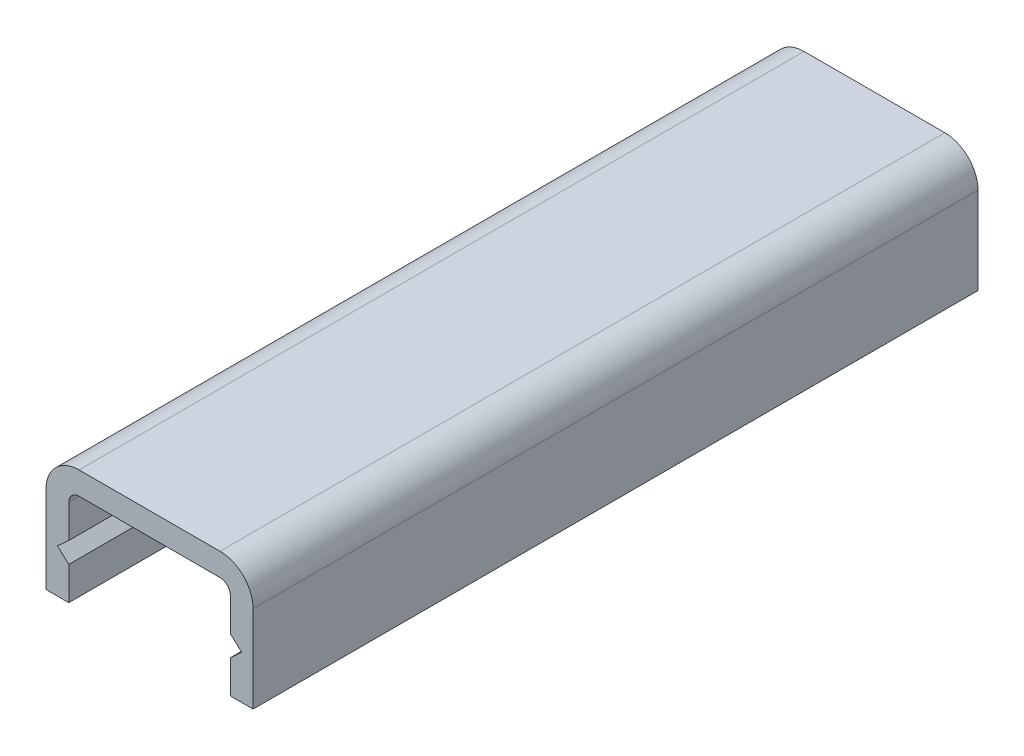
ISO-10303-21;
HEADER;
FILE_DESCRIPTION(('STEP AP214'),'2;1');
FILE_NAME('part.step','',(''),(''),'','','');
FILE_SCHEMA(('AUTOMOTIVE_DESIGN { 1 0 10303 214 1 1 1 1 }'));
ENDSEC;
DATA;
#1=APPLICATION_CONTEXT('core data for automotive mechanical design processes');
#2=APPLICATION_PROTOCOL_DEFINITION('international standard','automotive_design',2000,#1);
#3=PRODUCT_CONTEXT('',#1,'mechanical');
#4=PRODUCT('Part','Part','',(#3));
#5=PRODUCT_RELATED_PRODUCT_CATEGORY('part','',(#4));
#6=PRODUCT_DEFINITION_FORMATION('','',#4);
#7=PRODUCT_DEFINITION_CONTEXT('part definition',#1,'design');
#8=PRODUCT_DEFINITION('design','',#6,#7);
#9=PRODUCT_DEFINITION_SHAPE('','',#8);
#10=(LENGTH_UNIT() NAMED_UNIT(*) SI_UNIT(.MILLI.,.METRE.));
#11=(NAMED_UNIT(*) PLANE_ANGLE_UNIT() SI_UNIT($,.RADIAN.));
#12=(NAMED_UNIT(*) SI_UNIT($,.STERADIAN.) SOLID_ANGLE_UNIT());
#13=UNCERTAINTY_MEASURE_WITH_UNIT(LENGTH_MEASURE(1.E-05),#10,'distance_accuracy_value','');
#14=(GEOMETRIC_REPRESENTATION_CONTEXT(3) GLOBAL_UNCERTAINTY_ASSIGNED_CONTEXT((#13)) GLOBAL_UNIT_ASSIGNED_CONTEXT((#10,
#11,#12)) REPRESENTATION_CONTEXT('',''));
#15=CARTESIAN_POINT('',(0.,0.,0.));
#16=DIRECTION('',(0.,0.,1.));
#17=DIRECTION('',(1.,0.,0.));
#18=AXIS2_PLACEMENT_3D('',#15,#16,#17);
#19=CARTESIAN_POINT('',(0.,0.,35.));
#20=DIRECTION('',(0.,1.,0.));
#21=DIRECTION('',(0.,0.,1.));
#22=AXIS2_PLACEMENT_3D('',#19,#20,#21);
#23=PLANE('',#22);
#24=DIRECTION('',(1.,0.,0.));
#25=VECTOR('',#24,1.);
#26=CARTESIAN_POINT('',(0.,0.,0.));
#27=LINE('',#26,#25);
#28=CARTESIAN_POINT('',(0.,0.,0.));
#29=VERTEX_POINT('',#28);
#30=CARTESIAN_POINT('',(1.1,0.,0.));
#31=VERTEX_POINT('',#30);
#32=EDGE_CURVE('E187',#29,#31,#27,.T.);
#33=ORIENTED_EDGE('',*,*,#32,.T.);
#34=DIRECTION('',(0.,0.,-1.));
#35=VECTOR('',#34,1.);
#36=CARTESIAN_POINT('',(1.1,0.,35.));
#37=LINE('',#36,#35);
#38=CARTESIAN_POINT('',(1.1,0.,35.));
#39=VERTEX_POINT('',#38);
#40=EDGE_CURVE('E11',#39,#31,#37,.T.);
#41=ORIENTED_EDGE('',*,*,#40,.F.);
#42=DIRECTION('',(1.,0.,0.));
#43=VECTOR('',#42,1.);
#44=CARTESIAN_POINT('',(0.,0.,35.));
#45=LINE('',#44,#43);
#46=CARTESIAN_POINT('',(0.,0.,35.));
#47=VERTEX_POINT('',#46);
#48=EDGE_CURVE('E221',#47,#39,#45,.T.);
#49=ORIENTED_EDGE('',*,*,#48,.F.);
#50=DIRECTION('',(0.,0.,-1.));
#51=VECTOR('',#50,1.);
#52=CARTESIAN_POINT('',(0.,0.,35.));
#53=LINE('',#52,#51);
#54=EDGE_CURVE('E183',#47,#29,#53,.T.);
#55=ORIENTED_EDGE('',*,*,#54,.T.);
#56=EDGE_LOOP('',(#33,#41,#49,#55));
#57=FACE_BOUND('',#56,.T.);
#58=ADVANCED_FACE('F31',(#57),#23,.F.);
#59=CARTESIAN_POINT('',(1.1,1.6,35.));
#60=DIRECTION('',(-1.,0.,0.));
#61=DIRECTION('',(0.,0.,1.));
#62=AXIS2_PLACEMENT_3D('',#59,#60,#61);
#63=PLANE('',#62);
#64=DIRECTION('',(0.,1.,0.));
#65=VECTOR('',#64,1.);
#66=CARTESIAN_POINT('',(1.1,1.6,0.));
#67=LINE('',#66,#65);
#68=CARTESIAN_POINT('',(1.1,1.6,0.));
#69=VERTEX_POINT('',#68);
#70=EDGE_CURVE('E190',#31,#69,#67,.T.);
#71=ORIENTED_EDGE('',*,*,#70,.T.);
#72=DIRECTION('',(0.,0.,-1.));
#73=VECTOR('',#72,1.);
#74=CARTESIAN_POINT('',(1.1,1.6,35.));
#75=LINE('',#74,#73);
#76=CARTESIAN_POINT('',(1.1,1.6,35.));
#77=VERTEX_POINT('',#76);
#78=EDGE_CURVE('E39',#77,#69,#75,.T.);
#79=ORIENTED_EDGE('',*,*,#78,.F.);
#80=DIRECTION('',(0.,1.,0.));
#81=VECTOR('',#80,1.);
#82=CARTESIAN_POINT('',(1.1,1.6,35.));
#83=LINE('',#82,#81);
#84=EDGE_CURVE('E120',#39,#77,#83,.T.);
#85=ORIENTED_EDGE('',*,*,#84,.F.);
#86=ORIENTED_EDGE('',*,*,#40,.T.);
#87=EDGE_LOOP('',(#71,#79,#85,#86));
#88=FACE_BOUND('',#87,.T.);
#89=ADVANCED_FACE('F329',(#88),#63,.F.);
#90=CARTESIAN_POINT('',(1.1,1.6,35.));
#91=DIRECTION('',(-0.672672793996314,-0.739940073395943,0.));
#92=DIRECTION('',(0.739940073395943,-0.672672793996314,0.));
#93=AXIS2_PLACEMENT_3D('',#90,#91,#92);
#94=PLANE('',#93);
#95=DIRECTION('',(-0.739940073395943,0.672672793996314,0.));
#96=VECTOR('',#95,1.);
#97=CARTESIAN_POINT('',(1.1,1.6,0.));
#98=LINE('',#97,#96);
#99=CARTESIAN_POINT('',(0.55,2.1,0.));
#100=VERTEX_POINT('',#99);
#101=EDGE_CURVE('E192',#69,#100,#98,.T.);
#102=ORIENTED_EDGE('',*,*,#101,.T.);
#103=DIRECTION('',(0.,0.,-1.));
#104=VECTOR('',#103,1.);
#105=CARTESIAN_POINT('',(0.55,2.1,35.));
#106=LINE('',#105,#104);
#107=CARTESIAN_POINT('',(0.55,2.1,35.));
#108=VERTEX_POINT('',#107);
#109=EDGE_CURVE('E258',#108,#100,#106,.T.);
#110=ORIENTED_EDGE('',*,*,#109,.F.);
#111=DIRECTION('',(-0.739940073395943,0.672672793996314,0.));
#112=VECTOR('',#111,1.);
#113=CARTESIAN_POINT('',(1.1,1.6,35.));
#114=LINE('',#113,#112);
#115=EDGE_CURVE('E266',#77,#108,#114,.T.);
#116=ORIENTED_EDGE('',*,*,#115,.F.);
#117=ORIENTED_EDGE('',*,*,#78,.T.);
#118=EDGE_LOOP('',(#102,#110,#116,#117));
#119=FACE_BOUND('',#118,.T.);
#120=ADVANCED_FACE('F264',(#119),#94,.F.);
#121=CARTESIAN_POINT('',(1.1,2.6,35.));
#122=DIRECTION('',(-0.672672793996311,0.739940073395945,0.));
#123=DIRECTION('',(-0.739940073395945,-0.672672793996311,0.));
#124=AXIS2_PLACEMENT_3D('',#121,#122,#123);
#125=PLANE('',#124);
#126=DIRECTION('',(0.739940073395945,0.672672793996311,0.));
#127=VECTOR('',#126,1.);
#128=CARTESIAN_POINT('',(1.1,2.6,0.));
#129=LINE('',#128,#127);
#130=CARTESIAN_POINT('',(1.1,2.6,0.));
#131=VERTEX_POINT('',#130);
#132=EDGE_CURVE('E194',#100,#131,#129,.T.);
#133=ORIENTED_EDGE('',*,*,#132,.T.);
#134=DIRECTION('',(0.,0.,-1.));
#135=VECTOR('',#134,1.);
#136=CARTESIAN_POINT('',(1.1,2.6,35.));
#137=LINE('',#136,#135);
#138=CARTESIAN_POINT('',(1.1,2.6,35.));
#139=VERTEX_POINT('',#138);
#140=EDGE_CURVE('E255',#139,#131,#137,.T.);
#141=ORIENTED_EDGE('',*,*,#140,.F.);
#142=DIRECTION('',(0.739940073395945,0.672672793996311,0.));
#143=VECTOR('',#142,1.);
#144=CARTESIAN_POINT('',(1.1,2.6,35.));
#145=LINE('',#144,#143);
#146=EDGE_CURVE('E284',#108,#139,#145,.T.);
#147=ORIENTED_EDGE('',*,*,#146,.F.);
#148=ORIENTED_EDGE('',*,*,#109,.T.);
#149=EDGE_LOOP('',(#133,#141,#147,#148));
#150=FACE_BOUND('',#149,.T.);
#151=ADVANCED_FACE('F275',(#150),#125,.F.);
#152=CARTESIAN_POINT('',(1.1,4.2,35.));
#153=DIRECTION('',(-1.,0.,0.));
#154=DIRECTION('',(0.,-1.,0.));
#155=AXIS2_PLACEMENT_3D('',#152,#153,#154);
#156=PLANE('',#155);
#157=DIRECTION('',(0.,1.,0.));
#158=VECTOR('',#157,1.);
#159=CARTESIAN_POINT('',(1.1,4.2,0.));
#160=LINE('',#159,#158);
#161=CARTESIAN_POINT('',(1.1,4.2,0.));
#162=VERTEX_POINT('',#161);
#163=EDGE_CURVE('E196',#131,#162,#160,.T.);
#164=ORIENTED_EDGE('',*,*,#163,.T.);
#165=DIRECTION('',(0.,0.,-1.));
#166=VECTOR('',#165,1.);
#167=CARTESIAN_POINT('',(1.1,4.2,35.));
#168=LINE('',#167,#166);
#169=CARTESIAN_POINT('',(1.1,4.2,35.));
#170=VERTEX_POINT('',#169);
#171=EDGE_CURVE('E252',#170,#162,#168,.T.);
#172=ORIENTED_EDGE('',*,*,#171,.F.);
#173=DIRECTION('',(0.,1.,0.));
#174=VECTOR('',#173,1.);
#175=CARTESIAN_POINT('',(1.1,4.2,35.));
#176=LINE('',#175,#174);
#177=EDGE_CURVE('E281',#139,#170,#176,.T.);
#178=ORIENTED_EDGE('',*,*,#177,.F.);
#179=ORIENTED_EDGE('',*,*,#140,.T.);
#180=EDGE_LOOP('',(#164,#172,#178,#179));
#181=FACE_BOUND('',#180,.T.);
#182=ADVANCED_FACE('F279',(#181),#156,.F.);
#183=CARTESIAN_POINT('',(1.59999999999999,4.2,35.));
#184=DIRECTION('',(0.,0.,-1.));
#185=DIRECTION('',(-1.,0.,0.));
#186=AXIS2_PLACEMENT_3D('',#183,#184,#185);
#187=CYLINDRICAL_SURFACE('',#186,0.499999999999992);
#188=CARTESIAN_POINT('',(1.59999999999999,4.2,0.));
#189=DIRECTION('',(0.,0.,-1.));
#190=DIRECTION('',(1.,0.,0.));
#191=AXIS2_PLACEMENT_3D('',#188,#189,#190);
#192=CIRCLE('',#191,0.499999999999992);
#193=CARTESIAN_POINT('',(1.59999999999999,4.69999999999999,0.));
#194=VERTEX_POINT('',#193);
#195=EDGE_CURVE('E198',#162,#194,#192,.T.);
#196=ORIENTED_EDGE('',*,*,#195,.T.);
#197=DIRECTION('',(0.,0.,-1.));
#198=VECTOR('',#197,1.);
#199=CARTESIAN_POINT('',(1.59999999999999,4.69999999999999,35.));
#200=LINE('',#199,#198);
#201=CARTESIAN_POINT('',(1.59999999999999,4.69999999999999,35.));
#202=VERTEX_POINT('',#201);
#203=EDGE_CURVE('E249',#202,#194,#200,.T.);
#204=ORIENTED_EDGE('',*,*,#203,.F.);
#205=CARTESIAN_POINT('',(1.59999999999999,4.2,35.));
#206=DIRECTION('',(0.,0.,-1.));
#207=DIRECTION('',(1.,0.,0.));
#208=AXIS2_PLACEMENT_3D('',#205,#206,#207);
#209=CIRCLE('',#208,0.499999999999992);
#210=EDGE_CURVE('E283',#170,#202,#209,.T.);
#211=ORIENTED_EDGE('',*,*,#210,.F.);
#212=ORIENTED_EDGE('',*,*,#171,.T.);
#213=EDGE_LOOP('',(#196,#204,#211,#212));
#214=FACE_BOUND('',#213,.T.);
#215=ADVANCED_FACE('F342',(#214),#187,.F.);
#216=CARTESIAN_POINT('',(1.59999999999999,4.69999999999999,35.));
#217=DIRECTION('',(0.,1.,0.));
#218=DIRECTION('',(0.,0.,1.));
#219=AXIS2_PLACEMENT_3D('',#216,#217,#218);
#220=PLANE('',#219);
#221=DIRECTION('',(1.,0.,0.));
#222=VECTOR('',#221,1.);
#223=CARTESIAN_POINT('',(1.59999999999999,4.69999999999999,0.));
#224=LINE('',#223,#222);
#225=CARTESIAN_POINT('',(8.39999999999998,4.69999999999999,0.));
#226=VERTEX_POINT('',#225);
#227=EDGE_CURVE('E200',#194,#226,#224,.T.);
#228=ORIENTED_EDGE('',*,*,#227,.T.);
#229=DIRECTION('',(0.,0.,-1.));
#230=VECTOR('',#229,1.);
#231=CARTESIAN_POINT('',(8.39999999999998,4.69999999999999,35.));
#232=LINE('',#231,#230);
#233=CARTESIAN_POINT('',(8.39999999999998,4.69999999999999,35.));
#234=VERTEX_POINT('',#233);
#235=EDGE_CURVE('E246',#234,#226,#232,.T.);
#236=ORIENTED_EDGE('',*,*,#235,.F.);
#237=DIRECTION('',(1.,0.,0.));
#238=VECTOR('',#237,1.);
#239=CARTESIAN_POINT('',(1.59999999999999,4.69999999999999,35.));
#240=LINE('',#239,#238);
#241=EDGE_CURVE('E286',#202,#234,#240,.T.);
#242=ORIENTED_EDGE('',*,*,#241,.F.);
#243=ORIENTED_EDGE('',*,*,#203,.T.);
#244=EDGE_LOOP('',(#228,#236,#242,#243));
#245=FACE_BOUND('',#244,.T.);
#246=ADVANCED_FACE('F345',(#245),#220,.F.);
#247=CARTESIAN_POINT('',(8.39999999999998,4.2,35.));
#248=DIRECTION('',(0.,0.,-1.));
#249=DIRECTION('',(-1.,0.,0.));
#250=AXIS2_PLACEMENT_3D('',#247,#248,#249);
#251=CYLINDRICAL_SURFACE('',#250,0.499999999999991);
#252=CARTESIAN_POINT('',(8.39999999999998,4.2,0.));
#253=DIRECTION('',(0.,0.,-1.));
#254=DIRECTION('',(1.,0.,0.));
#255=AXIS2_PLACEMENT_3D('',#252,#253,#254);
#256=CIRCLE('',#255,0.499999999999991);
#257=CARTESIAN_POINT('',(8.89999999999997,4.2,0.));
#258=VERTEX_POINT('',#257);
#259=EDGE_CURVE('E202',#226,#258,#256,.T.);
#260=ORIENTED_EDGE('',*,*,#259,.T.);
#261=DIRECTION('',(0.,0.,-1.));
#262=VECTOR('',#261,1.);
#263=CARTESIAN_POINT('',(8.89999999999997,4.2,35.));
#264=LINE('',#263,#262);
#265=CARTESIAN_POINT('',(8.89999999999997,4.2,35.));
#266=VERTEX_POINT('',#265);
#267=EDGE_CURVE('E243',#266,#258,#264,.T.);
#268=ORIENTED_EDGE('',*,*,#267,.F.);
#269=CARTESIAN_POINT('',(8.39999999999998,4.2,35.));
#270=DIRECTION('',(0.,0.,-1.));
#271=DIRECTION('',(1.,0.,0.));
#272=AXIS2_PLACEMENT_3D('',#269,#270,#271);
#273=CIRCLE('',#272,0.499999999999991);
#274=EDGE_CURVE('E292',#234,#266,#273,.T.);
#275=ORIENTED_EDGE('',*,*,#274,.F.);
#276=ORIENTED_EDGE('',*,*,#235,.T.);
#277=EDGE_LOOP('',(#260,#268,#275,#276));
#278=FACE_BOUND('',#277,.T.);
#279=ADVANCED_FACE('F349',(#278),#251,.F.);
#280=CARTESIAN_POINT('',(8.89999999999997,4.2,35.));
#281=DIRECTION('',(1.,0.,0.));
#282=DIRECTION('',(0.,1.,0.));
#283=AXIS2_PLACEMENT_3D('',#280,#281,#282);
#284=PLANE('',#283);
#285=DIRECTION('',(0.,-1.,0.));
#286=VECTOR('',#285,1.);
#287=CARTESIAN_POINT('',(8.89999999999997,4.2,0.));
#288=LINE('',#287,#286);
#289=CARTESIAN_POINT('',(8.89999999999998,2.6,0.));
#290=VERTEX_POINT('',#289);
#291=EDGE_CURVE('E204',#258,#290,#288,.T.);
#292=ORIENTED_EDGE('',*,*,#291,.T.);
#293=DIRECTION('',(0.,0.,-1.));
#294=VECTOR('',#293,1.);
#295=CARTESIAN_POINT('',(8.89999999999998,2.6,35.));
#296=LINE('',#295,#294);
#297=CARTESIAN_POINT('',(8.89999999999998,2.6,35.));
#298=VERTEX_POINT('',#297);
#299=EDGE_CURVE('E240',#298,#290,#296,.T.);
#300=ORIENTED_EDGE('',*,*,#299,.F.);
#301=DIRECTION('',(0.,-1.,0.));
#302=VECTOR('',#301,1.);
#303=CARTESIAN_POINT('',(8.89999999999997,4.2,35.));
#304=LINE('',#303,#302);
#305=EDGE_CURVE('E294',#266,#298,#304,.T.);
#306=ORIENTED_EDGE('',*,*,#305,.F.);
#307=ORIENTED_EDGE('',*,*,#267,.T.);
#308=EDGE_LOOP('',(#292,#300,#306,#307));
#309=FACE_BOUND('',#308,.T.);
#310=ADVANCED_FACE('F353',(#309),#284,.F.);
#311=CARTESIAN_POINT('',(8.89999999999998,2.6,35.));
#312=DIRECTION('',(0.672672793996294,0.739940073395961,0.));
#313=DIRECTION('',(-0.739940073395961,0.672672793996294,0.));
#314=AXIS2_PLACEMENT_3D('',#311,#312,#313);
#315=PLANE('',#314);
#316=DIRECTION('',(0.739940073395961,-0.672672793996294,0.));
#317=VECTOR('',#316,1.);
#318=CARTESIAN_POINT('',(8.89999999999998,2.6,0.));
#319=LINE('',#318,#317);
#320=CARTESIAN_POINT('',(9.45,2.1,0.));
#321=VERTEX_POINT('',#320);
#322=EDGE_CURVE('E206',#290,#321,#319,.T.);
#323=ORIENTED_EDGE('',*,*,#322,.T.);
#324=DIRECTION('',(0.,0.,-1.));
#325=VECTOR('',#324,1.);
#326=CARTESIAN_POINT('',(9.45,2.1,35.));
#327=LINE('',#326,#325);
#328=CARTESIAN_POINT('',(9.45,2.1,35.));
#329=VERTEX_POINT('',#328);
#330=EDGE_CURVE('E237',#329,#321,#327,.T.);
#331=ORIENTED_EDGE('',*,*,#330,.F.);
#332=DIRECTION('',(0.739940073395961,-0.672672793996294,0.));
#333=VECTOR('',#332,1.);
#334=CARTESIAN_POINT('',(8.89999999999998,2.6,35.));
#335=LINE('',#334,#333);
#336=EDGE_CURVE('E296',#298,#329,#335,.T.);
#337=ORIENTED_EDGE('',*,*,#336,.F.);
#338=ORIENTED_EDGE('',*,*,#299,.T.);
#339=EDGE_LOOP('',(#323,#331,#337,#338));
#340=FACE_BOUND('',#339,.T.);
#341=ADVANCED_FACE('F357',(#340),#315,.F.);
#342=CARTESIAN_POINT('',(8.89999999999998,1.6,35.));
#343=DIRECTION('',(0.672672793996296,-0.739940073395959,0.));
#344=DIRECTION('',(0.739940073395959,0.672672793996296,0.));
#345=AXIS2_PLACEMENT_3D('',#342,#343,#344);
#346=PLANE('',#345);
#347=DIRECTION('',(-0.739940073395959,-0.672672793996296,0.));
#348=VECTOR('',#347,1.);
#349=CARTESIAN_POINT('',(8.89999999999998,1.6,0.));
#350=LINE('',#349,#348);
#351=CARTESIAN_POINT('',(8.89999999999998,1.6,0.));
#352=VERTEX_POINT('',#351);
#353=EDGE_CURVE('E208',#321,#352,#350,.T.);
#354=ORIENTED_EDGE('',*,*,#353,.T.);
#355=DIRECTION('',(0.,0.,-1.));
#356=VECTOR('',#355,1.);
#357=CARTESIAN_POINT('',(8.89999999999998,1.6,35.));
#358=LINE('',#357,#356);
#359=CARTESIAN_POINT('',(8.89999999999998,1.6,35.));
#360=VERTEX_POINT('',#359);
#361=EDGE_CURVE('E234',#360,#352,#358,.T.);
#362=ORIENTED_EDGE('',*,*,#361,.F.);
#363=DIRECTION('',(-0.739940073395959,-0.672672793996296,0.));
#364=VECTOR('',#363,1.);
#365=CARTESIAN_POINT('',(8.89999999999998,1.6,35.));
#366=LINE('',#365,#364);
#367=EDGE_CURVE('E298',#329,#360,#366,.T.);
#368=ORIENTED_EDGE('',*,*,#367,.F.);
#369=ORIENTED_EDGE('',*,*,#330,.T.);
#370=EDGE_LOOP('',(#354,#362,#368,#369));
#371=FACE_BOUND('',#370,.T.);
#372=ADVANCED_FACE('F361',(#371),#346,.F.);
#373=CARTESIAN_POINT('',(8.89999999999998,1.6,35.));
#374=DIRECTION('',(1.,0.,0.));
#375=DIRECTION('',(0.,0.,-1.));
#376=AXIS2_PLACEMENT_3D('',#373,#374,#375);
#377=PLANE('',#376);
#378=DIRECTION('',(0.,-1.,0.));
#379=VECTOR('',#378,1.);
#380=CARTESIAN_POINT('',(8.89999999999998,1.6,0.));
#381=LINE('',#380,#379);
#382=CARTESIAN_POINT('',(8.89999999999998,0.,0.));
#383=VERTEX_POINT('',#382);
#384=EDGE_CURVE('E210',#352,#383,#381,.T.);
#385=ORIENTED_EDGE('',*,*,#384,.T.);
#386=DIRECTION('',(0.,0.,-1.));
#387=VECTOR('',#386,1.);
#388=CARTESIAN_POINT('',(8.89999999999998,0.,35.));
#389=LINE('',#388,#387);
#390=CARTESIAN_POINT('',(8.89999999999998,0.,35.));
#391=VERTEX_POINT('',#390);
#392=EDGE_CURVE('E231',#391,#383,#389,.T.);
#393=ORIENTED_EDGE('',*,*,#392,.F.);
#394=DIRECTION('',(0.,-1.,0.));
#395=VECTOR('',#394,1.);
#396=CARTESIAN_POINT('',(8.89999999999998,1.6,35.));
#397=LINE('',#396,#395);
#398=EDGE_CURVE('E300',#360,#391,#397,.T.);
#399=ORIENTED_EDGE('',*,*,#398,.F.);
#400=ORIENTED_EDGE('',*,*,#361,.T.);
#401=EDGE_LOOP('',(#385,#393,#399,#400));
#402=FACE_BOUND('',#401,.T.);
#403=ADVANCED_FACE('F365',(#402),#377,.F.);
#404=CARTESIAN_POINT('',(9.99999999999998,0.,35.));
#405=DIRECTION('',(0.,1.,0.));
#406=DIRECTION('',(0.,0.,1.));
#407=AXIS2_PLACEMENT_3D('',#404,#405,#406);
#408=PLANE('',#407);
#409=DIRECTION('',(1.,0.,0.));
#410=VECTOR('',#409,1.);
#411=CARTESIAN_POINT('',(9.99999999999998,0.,0.));
#412=LINE('',#411,#410);
#413=CARTESIAN_POINT('',(9.99999999999998,0.,0.));
#414=VERTEX_POINT('',#413);
#415=EDGE_CURVE('E212',#383,#414,#412,.T.);
#416=ORIENTED_EDGE('',*,*,#415,.T.);
#417=DIRECTION('',(0.,0.,-1.));
#418=VECTOR('',#417,1.);
#419=CARTESIAN_POINT('',(9.99999999999998,0.,35.));
#420=LINE('',#419,#418);
#421=CARTESIAN_POINT('',(9.99999999999998,0.,35.));
#422=VERTEX_POINT('',#421);
#423=EDGE_CURVE('E228',#422,#414,#420,.T.);
#424=ORIENTED_EDGE('',*,*,#423,.F.);
#425=DIRECTION('',(1.,0.,0.));
#426=VECTOR('',#425,1.);
#427=CARTESIAN_POINT('',(9.99999999999998,0.,35.));
#428=LINE('',#427,#426);
#429=EDGE_CURVE('E302',#391,#422,#428,.T.);
#430=ORIENTED_EDGE('',*,*,#429,.F.);
#431=ORIENTED_EDGE('',*,*,#392,.T.);
#432=EDGE_LOOP('',(#416,#424,#430,#431));
#433=FACE_BOUND('',#432,.T.);
#434=ADVANCED_FACE('F369',(#433),#408,.F.);
#435=CARTESIAN_POINT('',(9.99999999999998,4.19999999999999,35.));
#436=DIRECTION('',(-1.,0.,0.));
#437=DIRECTION('',(0.,0.,1.));
#438=AXIS2_PLACEMENT_3D('',#435,#436,#437);
#439=PLANE('',#438);
#440=DIRECTION('',(0.,1.,0.));
#441=VECTOR('',#440,1.);
#442=CARTESIAN_POINT('',(9.99999999999998,4.19999999999999,0.));
#443=LINE('',#442,#441);
#444=CARTESIAN_POINT('',(9.99999999999998,4.19999999999999,0.));
#445=VERTEX_POINT('',#444);
#446=EDGE_CURVE('E214',#414,#445,#443,.T.);
#447=ORIENTED_EDGE('',*,*,#446,.T.);
#448=DIRECTION('',(0.,0.,-1.));
#449=VECTOR('',#448,1.);
#450=CARTESIAN_POINT('',(9.99999999999998,4.19999999999999,35.));
#451=LINE('',#450,#449);
#452=CARTESIAN_POINT('',(9.99999999999998,4.19999999999999,35.));
#453=VERTEX_POINT('',#452);
#454=EDGE_CURVE('E225',#453,#445,#451,.T.);
#455=ORIENTED_EDGE('',*,*,#454,.F.);
#456=DIRECTION('',(0.,1.,0.));
#457=VECTOR('',#456,1.);
#458=CARTESIAN_POINT('',(9.99999999999998,4.19999999999999,35.));
#459=LINE('',#458,#457);
#460=EDGE_CURVE('E304',#422,#453,#459,.T.);
#461=ORIENTED_EDGE('',*,*,#460,.F.);
#462=ORIENTED_EDGE('',*,*,#423,.T.);
#463=EDGE_LOOP('',(#447,#455,#461,#462));
#464=FACE_BOUND('',#463,.T.);
#465=ADVANCED_FACE('F310',(#464),#439,.F.);
#466=CARTESIAN_POINT('',(8.39999999999998,4.19999999999999,35.));
#467=DIRECTION('',(0.,0.,-1.));
#468=DIRECTION('',(-1.,0.,0.));
#469=AXIS2_PLACEMENT_3D('',#466,#467,#468);
#470=CYLINDRICAL_SURFACE('',#469,1.6);
#471=CARTESIAN_POINT('',(8.39999999999998,4.19999999999999,0.));
#472=DIRECTION('',(0.,0.,1.));
#473=DIRECTION('',(-1.,0.,0.));
#474=AXIS2_PLACEMENT_3D('',#471,#472,#473);
#475=CIRCLE('',#474,1.6);
#476=CARTESIAN_POINT('',(8.39999999999998,5.79999999999999,0.));
#477=VERTEX_POINT('',#476);
#478=EDGE_CURVE('E216',#445,#477,#475,.T.);
#479=ORIENTED_EDGE('',*,*,#478,.T.);
#480=DIRECTION('',(0.,0.,-1.));
#481=VECTOR('',#480,1.);
#482=CARTESIAN_POINT('',(8.39999999999998,5.79999999999999,35.));
#483=LINE('',#482,#481);
#484=CARTESIAN_POINT('',(8.39999999999998,5.79999999999999,35.));
#485=VERTEX_POINT('',#484);
#486=EDGE_CURVE('E178',#485,#477,#483,.T.);
#487=ORIENTED_EDGE('',*,*,#486,.F.);
#488=CARTESIAN_POINT('',(8.39999999999998,4.19999999999999,35.));
#489=DIRECTION('',(0.,0.,1.));
#490=DIRECTION('',(-1.,0.,0.));
#491=AXIS2_PLACEMENT_3D('',#488,#489,#490);
#492=CIRCLE('',#491,1.6);
#493=EDGE_CURVE('E169',#453,#485,#492,.T.);
#494=ORIENTED_EDGE('',*,*,#493,.F.);
#495=ORIENTED_EDGE('',*,*,#454,.T.);
#496=EDGE_LOOP('',(#479,#487,#494,#495));
#497=FACE_BOUND('',#496,.T.);
#498=ADVANCED_FACE('F314',(#497),#470,.T.);
#499=CARTESIAN_POINT('',(1.6,5.79999999999999,35.));
#500=DIRECTION('',(0.,-1.,0.));
#501=DIRECTION('',(0.,0.,-1.));
#502=AXIS2_PLACEMENT_3D('',#499,#500,#501);
#503=PLANE('',#502);
#504=DIRECTION('',(-1.,0.,0.));
#505=VECTOR('',#504,1.);
#506=CARTESIAN_POINT('',(1.6,5.79999999999999,0.));
#507=LINE('',#506,#505);
#508=CARTESIAN_POINT('',(1.6,5.79999999999999,0.));
#509=VERTEX_POINT('',#508);
#510=EDGE_CURVE('E177',#477,#509,#507,.T.);
#511=ORIENTED_EDGE('',*,*,#510,.T.);
#512=DIRECTION('',(0.,0.,-1.));
#513=VECTOR('',#512,1.);
#514=CARTESIAN_POINT('',(1.6,5.79999999999999,35.));
#515=LINE('',#514,#513);
#516=CARTESIAN_POINT('',(1.6,5.79999999999999,35.));
#517=VERTEX_POINT('',#516);
#518=EDGE_CURVE('E174',#517,#509,#515,.T.);
#519=ORIENTED_EDGE('',*,*,#518,.F.);
#520=DIRECTION('',(-1.,0.,0.));
#521=VECTOR('',#520,1.);
#522=CARTESIAN_POINT('',(1.6,5.79999999999999,35.));
#523=LINE('',#522,#521);
#524=EDGE_CURVE('E163',#485,#517,#523,.T.);
#525=ORIENTED_EDGE('',*,*,#524,.F.);
#526=ORIENTED_EDGE('',*,*,#486,.T.);
#527=EDGE_LOOP('',(#511,#519,#525,#526));
#528=FACE_BOUND('',#527,.T.);
#529=ADVANCED_FACE('F175',(#528),#503,.F.);
#530=CARTESIAN_POINT('',(1.6,4.19999999999999,35.));
#531=DIRECTION('',(0.,0.,-1.));
#532=DIRECTION('',(-1.,0.,0.));
#533=AXIS2_PLACEMENT_3D('',#530,#531,#532);
#534=CYLINDRICAL_SURFACE('',#533,1.6);
#535=CARTESIAN_POINT('',(1.6,4.19999999999999,0.));
#536=DIRECTION('',(0.,0.,1.));
#537=DIRECTION('',(-1.,0.,0.));
#538=AXIS2_PLACEMENT_3D('',#535,#536,#537);
#539=CIRCLE('',#538,1.6);
#540=CARTESIAN_POINT('',(0.,4.19999999999999,0.));
#541=VERTEX_POINT('',#540);
#542=EDGE_CURVE('E106',#509,#541,#539,.T.);
#543=ORIENTED_EDGE('',*,*,#542,.T.);
#544=DIRECTION('',(0.,0.,-1.));
#545=VECTOR('',#544,1.);
#546=CARTESIAN_POINT('',(0.,4.19999999999999,35.));
#547=LINE('',#546,#545);
#548=CARTESIAN_POINT('',(0.,4.19999999999999,35.));
#549=VERTEX_POINT('',#548);
#550=EDGE_CURVE('E179',#549,#541,#547,.T.);
#551=ORIENTED_EDGE('',*,*,#550,.F.);
#552=CARTESIAN_POINT('',(1.6,4.19999999999999,35.));
#553=DIRECTION('',(0.,0.,1.));
#554=DIRECTION('',(-1.,0.,0.));
#555=AXIS2_PLACEMENT_3D('',#552,#553,#554);
#556=CIRCLE('',#555,1.6);
#557=EDGE_CURVE('E167',#517,#549,#556,.T.);
#558=ORIENTED_EDGE('',*,*,#557,.F.);
#559=ORIENTED_EDGE('',*,*,#518,.T.);
#560=EDGE_LOOP('',(#543,#551,#558,#559));
#561=FACE_BOUND('',#560,.T.);
#562=ADVANCED_FACE('F181',(#561),#534,.T.);
#563=CARTESIAN_POINT('',(0.,4.19999999999999,35.));
#564=DIRECTION('',(1.,0.,0.));
#565=DIRECTION('',(0.,1.,0.));
#566=AXIS2_PLACEMENT_3D('',#563,#564,#565);
#567=PLANE('',#566);
#568=DIRECTION('',(0.,-1.,0.));
#569=VECTOR('',#568,1.);
#570=CARTESIAN_POINT('',(0.,4.19999999999999,0.));
#571=LINE('',#570,#569);
#572=EDGE_CURVE('E112',#541,#29,#571,.T.);
#573=ORIENTED_EDGE('',*,*,#572,.T.);
#574=ORIENTED_EDGE('',*,*,#54,.F.);
#575=DIRECTION('',(0.,-1.,0.));
#576=VECTOR('',#575,1.);
#577=CARTESIAN_POINT('',(0.,4.19999999999999,35.));
#578=LINE('',#577,#576);
#579=EDGE_CURVE('E47',#549,#47,#578,.T.);
#580=ORIENTED_EDGE('',*,*,#579,.F.);
#581=ORIENTED_EDGE('',*,*,#550,.T.);
#582=EDGE_LOOP('',(#573,#574,#580,#581));
#583=FACE_BOUND('',#582,.T.);
#584=ADVANCED_FACE('F318',(#583),#567,.F.);
#585=CARTESIAN_POINT('',(1.59999999999999,4.2,35.));
#586=DIRECTION('',(0.,0.,1.));
#587=DIRECTION('',(1.,0.,0.));
#588=AXIS2_PLACEMENT_3D('',#585,#586,#587);
#589=PLANE('',#588);
#590=ORIENTED_EDGE('',*,*,#48,.T.);
#591=ORIENTED_EDGE('',*,*,#84,.T.);
#592=ORIENTED_EDGE('',*,*,#115,.T.);
#593=ORIENTED_EDGE('',*,*,#146,.T.);
#594=ORIENTED_EDGE('',*,*,#177,.T.);
#595=ORIENTED_EDGE('',*,*,#210,.T.);
#596=ORIENTED_EDGE('',*,*,#241,.T.);
#597=ORIENTED_EDGE('',*,*,#274,.T.);
#598=ORIENTED_EDGE('',*,*,#305,.T.);
#599=ORIENTED_EDGE('',*,*,#336,.T.);
#600=ORIENTED_EDGE('',*,*,#367,.T.);
#601=ORIENTED_EDGE('',*,*,#398,.T.);
#602=ORIENTED_EDGE('',*,*,#429,.T.);
#603=ORIENTED_EDGE('',*,*,#460,.T.);
#604=ORIENTED_EDGE('',*,*,#493,.T.);
#605=ORIENTED_EDGE('',*,*,#524,.T.);
#606=ORIENTED_EDGE('',*,*,#557,.T.);
#607=ORIENTED_EDGE('',*,*,#579,.T.);
#608=EDGE_LOOP('',(#590,#591,#592,#593,#594,#595,#596,#597,#598,#599,#600,#601,#602,#603,#604,
#605,#606,#607));
#609=FACE_BOUND('',#608,.T.);
#610=ADVANCED_FACE('F165',(#609),#589,.T.);
#611=CARTESIAN_POINT('',(1.59999999999999,4.2,0.));
#612=DIRECTION('',(0.,0.,1.));
#613=DIRECTION('',(1.,0.,0.));
#614=AXIS2_PLACEMENT_3D('',#611,#612,#613);
#615=PLANE('',#614);
#616=ORIENTED_EDGE('',*,*,#32,.F.);
#617=ORIENTED_EDGE('',*,*,#572,.F.);
#618=ORIENTED_EDGE('',*,*,#542,.F.);
#619=ORIENTED_EDGE('',*,*,#510,.F.);
#620=ORIENTED_EDGE('',*,*,#478,.F.);
#621=ORIENTED_EDGE('',*,*,#446,.F.);
#622=ORIENTED_EDGE('',*,*,#415,.F.);
#623=ORIENTED_EDGE('',*,*,#384,.F.);
#624=ORIENTED_EDGE('',*,*,#353,.F.);
#625=ORIENTED_EDGE('',*,*,#322,.F.);
#626=ORIENTED_EDGE('',*,*,#291,.F.);
#627=ORIENTED_EDGE('',*,*,#259,.F.);
#628=ORIENTED_EDGE('',*,*,#227,.F.);
#629=ORIENTED_EDGE('',*,*,#195,.F.);
#630=ORIENTED_EDGE('',*,*,#163,.F.);
#631=ORIENTED_EDGE('',*,*,#132,.F.);
#632=ORIENTED_EDGE('',*,*,#101,.F.);
#633=ORIENTED_EDGE('',*,*,#70,.F.);
#634=EDGE_LOOP('',(#616,#617,#618,#619,#620,#621,#622,#623,#624,#625,#626,#627,#628,#629,#630,
#631,#632,#633));
#635=FACE_BOUND('',#634,.T.);
#636=ADVANCED_FACE('F270',(#635),#615,.F.);
#637=CLOSED_SHELL('',(#58,#89,#120,#151,#182,#215,#246,#279,#310,#341,#372,#403,#434,#465,#498,
#529,#562,#584,#610,#636));
#638=MANIFOLD_SOLID_BREP('B2',#637);
#639=ADVANCED_BREP_SHAPE_REPRESENTATION('',(#18,#638),#14);
#640=SHAPE_DEFINITION_REPRESENTATION(#9,#639);
ENDSEC;
END-ISO-10303-21;
